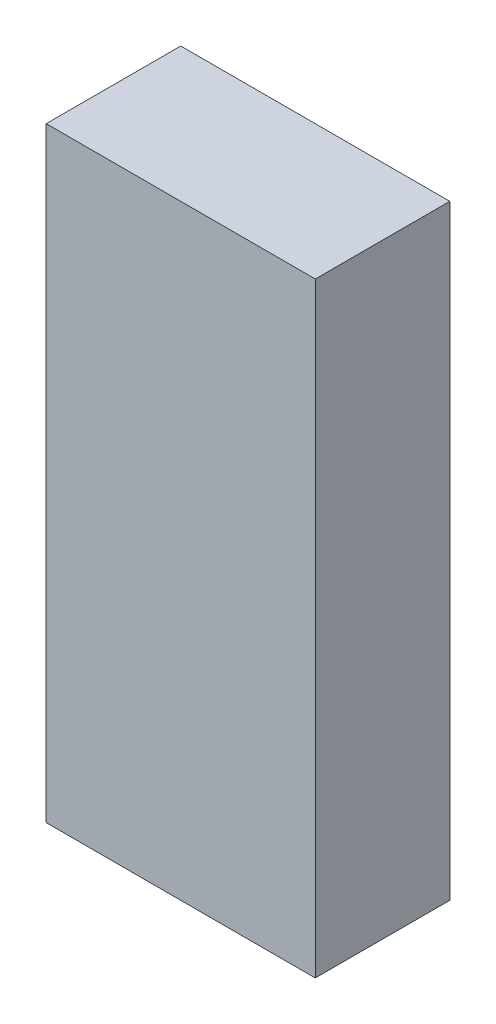
ISO-10303-21;
HEADER;
FILE_DESCRIPTION(('STEP AP214'),'2;1');
FILE_NAME('part.step','',(''),(''),'','','');
FILE_SCHEMA(('AUTOMOTIVE_DESIGN { 1 0 10303 214 1 1 1 1 }'));
ENDSEC;
DATA;
#1=APPLICATION_CONTEXT('core data for automotive mechanical design processes');
#2=APPLICATION_PROTOCOL_DEFINITION('international standard','automotive_design',2000,#1);
#3=PRODUCT_CONTEXT('',#1,'mechanical');
#4=PRODUCT('Part','Part','',(#3));
#5=PRODUCT_RELATED_PRODUCT_CATEGORY('part','',(#4));
#6=PRODUCT_DEFINITION_FORMATION('','',#4);
#7=PRODUCT_DEFINITION_CONTEXT('part definition',#1,'design');
#8=PRODUCT_DEFINITION('design','',#6,#7);
#9=PRODUCT_DEFINITION_SHAPE('','',#8);
#10=(LENGTH_UNIT() NAMED_UNIT(*) SI_UNIT(.MILLI.,.METRE.));
#11=(NAMED_UNIT(*) PLANE_ANGLE_UNIT() SI_UNIT($,.RADIAN.));
#12=(NAMED_UNIT(*) SI_UNIT($,.STERADIAN.) SOLID_ANGLE_UNIT());
#13=UNCERTAINTY_MEASURE_WITH_UNIT(LENGTH_MEASURE(1.E-05),#10,'distance_accuracy_value','');
#14=(GEOMETRIC_REPRESENTATION_CONTEXT(3) GLOBAL_UNCERTAINTY_ASSIGNED_CONTEXT((#13)) GLOBAL_UNIT_ASSIGNED_CONTEXT((#10,
#11,#12)) REPRESENTATION_CONTEXT('',''));
#15=CARTESIAN_POINT('',(0.,0.,0.));
#16=DIRECTION('',(0.,0.,1.));
#17=DIRECTION('',(1.,0.,0.));
#18=AXIS2_PLACEMENT_3D('',#15,#16,#17);
#19=CARTESIAN_POINT('',(0.9,2.525,0.));
#20=DIRECTION('',(1.,0.,0.));
#21=DIRECTION('',(0.,0.,1.));
#22=AXIS2_PLACEMENT_3D('',#19,#20,#21);
#23=PLANE('',#22);
#24=DIRECTION('',(0.,1.,0.));
#25=VECTOR('',#24,1.);
#26=CARTESIAN_POINT('',(0.9,2.525,0.1));
#27=LINE('',#26,#25);
#28=CARTESIAN_POINT('',(0.9,2.525,0.1));
#29=VERTEX_POINT('',#28);
#30=CARTESIAN_POINT('',(0.9,2.975,0.1));
#31=VERTEX_POINT('',#30);
#32=EDGE_CURVE('E11',#29,#31,#27,.T.);
#33=ORIENTED_EDGE('',*,*,#32,.T.);
#34=DIRECTION('',(0.,0.,1.));
#35=VECTOR('',#34,1.);
#36=CARTESIAN_POINT('',(0.9,2.975,0.));
#37=LINE('',#36,#35);
#38=CARTESIAN_POINT('',(0.9,2.975,0.));
#39=VERTEX_POINT('',#38);
#40=EDGE_CURVE('E24',#39,#31,#37,.T.);
#41=ORIENTED_EDGE('',*,*,#40,.F.);
#42=DIRECTION('',(0.,1.,0.));
#43=VECTOR('',#42,1.);
#44=CARTESIAN_POINT('',(0.9,2.525,0.));
#45=LINE('',#44,#43);
#46=CARTESIAN_POINT('',(0.9,2.525,0.));
#47=VERTEX_POINT('',#46);
#48=EDGE_CURVE('E86',#47,#39,#45,.T.);
#49=ORIENTED_EDGE('',*,*,#48,.F.);
#50=DIRECTION('',(0.,0.,1.));
#51=VECTOR('',#50,1.);
#52=CARTESIAN_POINT('',(0.9,2.525,0.));
#53=LINE('',#52,#51);
#54=EDGE_CURVE('E36',#47,#29,#53,.T.);
#55=ORIENTED_EDGE('',*,*,#54,.T.);
#56=EDGE_LOOP('',(#33,#41,#49,#55));
#57=FACE_BOUND('',#56,.T.);
#58=ADVANCED_FACE('F17',(#57),#23,.F.);
#59=CARTESIAN_POINT('',(1.1,2.525,0.));
#60=DIRECTION('',(1.,0.,0.));
#61=DIRECTION('',(0.,0.,1.));
#62=AXIS2_PLACEMENT_3D('',#59,#60,#61);
#63=PLANE('',#62);
#64=DIRECTION('',(0.,0.,1.));
#65=VECTOR('',#64,1.);
#66=CARTESIAN_POINT('',(1.1,2.525,0.));
#67=LINE('',#66,#65);
#68=CARTESIAN_POINT('',(1.1,2.525,0.));
#69=VERTEX_POINT('',#68);
#70=CARTESIAN_POINT('',(1.1,2.525,0.1));
#71=VERTEX_POINT('',#70);
#72=EDGE_CURVE('E83',#69,#71,#67,.T.);
#73=ORIENTED_EDGE('',*,*,#72,.F.);
#74=DIRECTION('',(0.,1.,0.));
#75=VECTOR('',#74,1.);
#76=CARTESIAN_POINT('',(1.1,2.525,0.));
#77=LINE('',#76,#75);
#78=CARTESIAN_POINT('',(1.1,2.975,0.));
#79=VERTEX_POINT('',#78);
#80=EDGE_CURVE('E63',#69,#79,#77,.T.);
#81=ORIENTED_EDGE('',*,*,#80,.T.);
#82=DIRECTION('',(0.,0.,1.));
#83=VECTOR('',#82,1.);
#84=CARTESIAN_POINT('',(1.1,2.975,0.));
#85=LINE('',#84,#83);
#86=CARTESIAN_POINT('',(1.1,2.975,0.1));
#87=VERTEX_POINT('',#86);
#88=EDGE_CURVE('E57',#79,#87,#85,.T.);
#89=ORIENTED_EDGE('',*,*,#88,.T.);
#90=DIRECTION('',(0.,1.,0.));
#91=VECTOR('',#90,1.);
#92=CARTESIAN_POINT('',(1.1,2.525,0.1));
#93=LINE('',#92,#91);
#94=EDGE_CURVE('E60',#71,#87,#93,.T.);
#95=ORIENTED_EDGE('',*,*,#94,.F.);
#96=EDGE_LOOP('',(#73,#81,#89,#95));
#97=FACE_BOUND('',#96,.T.);
#98=ADVANCED_FACE('F59',(#97),#63,.T.);
#99=CARTESIAN_POINT('',(0.9,2.525,0.));
#100=DIRECTION('',(0.,1.,0.));
#101=DIRECTION('',(0.,0.,1.));
#102=AXIS2_PLACEMENT_3D('',#99,#100,#101);
#103=PLANE('',#102);
#104=ORIENTED_EDGE('',*,*,#72,.T.);
#105=DIRECTION('',(1.,0.,0.));
#106=VECTOR('',#105,1.);
#107=CARTESIAN_POINT('',(0.9,2.525,0.1));
#108=LINE('',#107,#106);
#109=EDGE_CURVE('E71',#29,#71,#108,.T.);
#110=ORIENTED_EDGE('',*,*,#109,.F.);
#111=ORIENTED_EDGE('',*,*,#54,.F.);
#112=DIRECTION('',(1.,0.,0.));
#113=VECTOR('',#112,1.);
#114=CARTESIAN_POINT('',(0.9,2.525,0.));
#115=LINE('',#114,#113);
#116=EDGE_CURVE('E76',#47,#69,#115,.T.);
#117=ORIENTED_EDGE('',*,*,#116,.T.);
#118=EDGE_LOOP('',(#104,#110,#111,#117));
#119=FACE_BOUND('',#118,.T.);
#120=ADVANCED_FACE('F91',(#119),#103,.F.);
#121=CARTESIAN_POINT('',(0.9,2.975,0.));
#122=DIRECTION('',(0.,1.,0.));
#123=DIRECTION('',(0.,0.,1.));
#124=AXIS2_PLACEMENT_3D('',#121,#122,#123);
#125=PLANE('',#124);
#126=DIRECTION('',(1.,0.,0.));
#127=VECTOR('',#126,1.);
#128=CARTESIAN_POINT('',(0.9,2.975,0.));
#129=LINE('',#128,#127);
#130=EDGE_CURVE('E74',#39,#79,#129,.T.);
#131=ORIENTED_EDGE('',*,*,#130,.F.);
#132=ORIENTED_EDGE('',*,*,#40,.T.);
#133=DIRECTION('',(1.,0.,0.));
#134=VECTOR('',#133,1.);
#135=CARTESIAN_POINT('',(0.9,2.975,0.1));
#136=LINE('',#135,#134);
#137=EDGE_CURVE('E69',#31,#87,#136,.T.);
#138=ORIENTED_EDGE('',*,*,#137,.T.);
#139=ORIENTED_EDGE('',*,*,#88,.F.);
#140=EDGE_LOOP('',(#131,#132,#138,#139));
#141=FACE_BOUND('',#140,.T.);
#142=ADVANCED_FACE('F73',(#141),#125,.T.);
#143=CARTESIAN_POINT('',(0.9,2.525,0.));
#144=DIRECTION('',(0.,0.,1.));
#145=DIRECTION('',(1.,0.,0.));
#146=AXIS2_PLACEMENT_3D('',#143,#144,#145);
#147=PLANE('',#146);
#148=ORIENTED_EDGE('',*,*,#130,.T.);
#149=ORIENTED_EDGE('',*,*,#80,.F.);
#150=ORIENTED_EDGE('',*,*,#116,.F.);
#151=ORIENTED_EDGE('',*,*,#48,.T.);
#152=EDGE_LOOP('',(#148,#149,#150,#151));
#153=FACE_BOUND('',#152,.T.);
#154=ADVANCED_FACE('F89',(#153),#147,.F.);
#155=CARTESIAN_POINT('',(0.9,2.525,0.1));
#156=DIRECTION('',(0.,0.,1.));
#157=DIRECTION('',(1.,0.,0.));
#158=AXIS2_PLACEMENT_3D('',#155,#156,#157);
#159=PLANE('',#158);
#160=ORIENTED_EDGE('',*,*,#32,.F.);
#161=ORIENTED_EDGE('',*,*,#109,.T.);
#162=ORIENTED_EDGE('',*,*,#94,.T.);
#163=ORIENTED_EDGE('',*,*,#137,.F.);
#164=EDGE_LOOP('',(#160,#161,#162,#163));
#165=FACE_BOUND('',#164,.T.);
#166=ADVANCED_FACE('F68',(#165),#159,.T.);
#167=CLOSED_SHELL('',(#58,#98,#120,#142,#154,#166));
#168=MANIFOLD_SOLID_BREP('B1',#167);
#169=ADVANCED_BREP_SHAPE_REPRESENTATION('',(#18,#168),#14);
#170=SHAPE_DEFINITION_REPRESENTATION(#9,#169);
ENDSEC;
END-ISO-10303-21;
